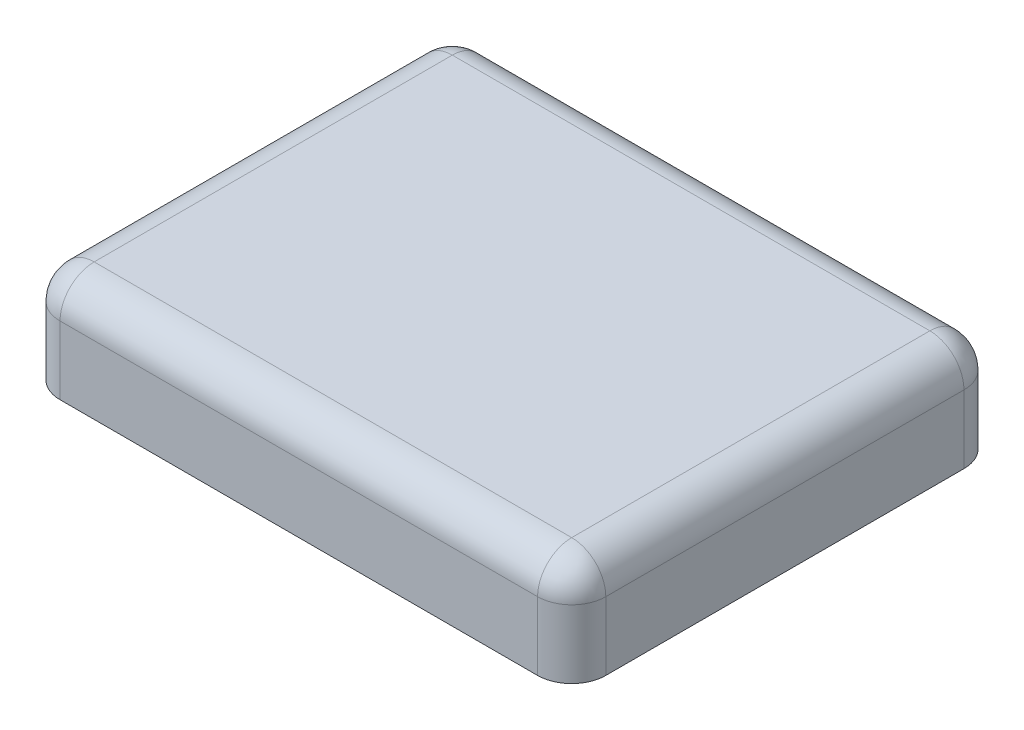
ISO-10303-21;
HEADER;
FILE_DESCRIPTION(('STEP AP214'),'2;1');
FILE_NAME('part.step','',(''),(''),'','','');
FILE_SCHEMA(('AUTOMOTIVE_DESIGN { 1 0 10303 214 1 1 1 1 }'));
ENDSEC;
DATA;
#1=APPLICATION_CONTEXT('core data for automotive mechanical design processes');
#2=APPLICATION_PROTOCOL_DEFINITION('international standard','automotive_design',2000,#1);
#3=PRODUCT_CONTEXT('',#1,'mechanical');
#4=PRODUCT('Part','Part','',(#3));
#5=PRODUCT_RELATED_PRODUCT_CATEGORY('part','',(#4));
#6=PRODUCT_DEFINITION_FORMATION('','',#4);
#7=PRODUCT_DEFINITION_CONTEXT('part definition',#1,'design');
#8=PRODUCT_DEFINITION('design','',#6,#7);
#9=PRODUCT_DEFINITION_SHAPE('','',#8);
#10=(LENGTH_UNIT() NAMED_UNIT(*) SI_UNIT(.MILLI.,.METRE.));
#11=(NAMED_UNIT(*) PLANE_ANGLE_UNIT() SI_UNIT($,.RADIAN.));
#12=(NAMED_UNIT(*) SI_UNIT($,.STERADIAN.) SOLID_ANGLE_UNIT());
#13=UNCERTAINTY_MEASURE_WITH_UNIT(LENGTH_MEASURE(1.E-05),#10,'distance_accuracy_value','');
#14=(GEOMETRIC_REPRESENTATION_CONTEXT(3) GLOBAL_UNCERTAINTY_ASSIGNED_CONTEXT((#13)) GLOBAL_UNIT_ASSIGNED_CONTEXT((#10,
#11,#12)) REPRESENTATION_CONTEXT('',''));
#15=CARTESIAN_POINT('',(0.,0.,0.));
#16=DIRECTION('',(0.,0.,1.));
#17=DIRECTION('',(1.,0.,0.));
#18=AXIS2_PLACEMENT_3D('',#15,#16,#17);
#19=CARTESIAN_POINT('',(1.6,0.6,-1.25));
#20=DIRECTION('',(-1.,0.,0.));
#21=DIRECTION('',(0.,0.,1.));
#22=AXIS2_PLACEMENT_3D('',#19,#20,#21);
#23=PLANE('',#22);
#24=DIRECTION('',(0.,-1.,0.));
#25=VECTOR('',#24,1.);
#26=CARTESIAN_POINT('',(1.6,0.6,-1.05));
#27=LINE('',#26,#25);
#28=CARTESIAN_POINT('',(1.6,0.,-1.05));
#29=VERTEX_POINT('',#28);
#30=CARTESIAN_POINT('',(1.6,0.4,-1.05));
#31=VERTEX_POINT('',#30);
#32=EDGE_CURVE('E127',#29,#31,#27,.F.);
#33=ORIENTED_EDGE('',*,*,#32,.T.);
#34=DIRECTION('',(0.,0.,-1.));
#35=VECTOR('',#34,1.);
#36=CARTESIAN_POINT('',(1.6,0.4,1.05));
#37=LINE('',#36,#35);
#38=CARTESIAN_POINT('',(1.6,0.4,1.05));
#39=VERTEX_POINT('',#38);
#40=EDGE_CURVE('E67',#31,#39,#37,.F.);
#41=ORIENTED_EDGE('',*,*,#40,.T.);
#42=DIRECTION('',(0.,-1.,0.));
#43=VECTOR('',#42,1.);
#44=CARTESIAN_POINT('',(1.6,0.6,1.05));
#45=LINE('',#44,#43);
#46=CARTESIAN_POINT('',(1.6,0.,1.05));
#47=VERTEX_POINT('',#46);
#48=EDGE_CURVE('E120',#39,#47,#45,.T.);
#49=ORIENTED_EDGE('',*,*,#48,.T.);
#50=DIRECTION('',(0.,0.,-1.));
#51=VECTOR('',#50,1.);
#52=CARTESIAN_POINT('',(1.6,0.,-1.25));
#53=LINE('',#52,#51);
#54=EDGE_CURVE('E123',#47,#29,#53,.T.);
#55=ORIENTED_EDGE('',*,*,#54,.T.);
#56=EDGE_LOOP('',(#33,#41,#49,#55));
#57=FACE_BOUND('',#56,.T.);
#58=ADVANCED_FACE('F43',(#57),#23,.F.);
#59=CARTESIAN_POINT('',(-1.6,0.6,-1.25));
#60=DIRECTION('',(0.,0.,1.));
#61=DIRECTION('',(1.,0.,0.));
#62=AXIS2_PLACEMENT_3D('',#59,#60,#61);
#63=PLANE('',#62);
#64=DIRECTION('',(0.,-1.,0.));
#65=VECTOR('',#64,1.);
#66=CARTESIAN_POINT('',(-1.4,0.6,-1.25));
#67=LINE('',#66,#65);
#68=CARTESIAN_POINT('',(-1.4,0.,-1.25));
#69=VERTEX_POINT('',#68);
#70=CARTESIAN_POINT('',(-1.4,0.4,-1.25));
#71=VERTEX_POINT('',#70);
#72=EDGE_CURVE('E160',#69,#71,#67,.F.);
#73=ORIENTED_EDGE('',*,*,#72,.T.);
#74=DIRECTION('',(-1.,0.,0.));
#75=VECTOR('',#74,1.);
#76=CARTESIAN_POINT('',(1.4,0.4,-1.25));
#77=LINE('',#76,#75);
#78=CARTESIAN_POINT('',(1.4,0.4,-1.25));
#79=VERTEX_POINT('',#78);
#80=EDGE_CURVE('E186',#71,#79,#77,.F.);
#81=ORIENTED_EDGE('',*,*,#80,.T.);
#82=DIRECTION('',(0.,-1.,0.));
#83=VECTOR('',#82,1.);
#84=CARTESIAN_POINT('',(1.4,0.6,-1.25));
#85=LINE('',#84,#83);
#86=CARTESIAN_POINT('',(1.4,0.,-1.25));
#87=VERTEX_POINT('',#86);
#88=EDGE_CURVE('E163',#79,#87,#85,.T.);
#89=ORIENTED_EDGE('',*,*,#88,.T.);
#90=DIRECTION('',(-1.,0.,0.));
#91=VECTOR('',#90,1.);
#92=CARTESIAN_POINT('',(-1.6,0.,-1.25));
#93=LINE('',#92,#91);
#94=EDGE_CURVE('E141',#87,#69,#93,.T.);
#95=ORIENTED_EDGE('',*,*,#94,.T.);
#96=EDGE_LOOP('',(#73,#81,#89,#95));
#97=FACE_BOUND('',#96,.T.);
#98=ADVANCED_FACE('F245',(#97),#63,.F.);
#99=CARTESIAN_POINT('',(-1.6,0.6,-1.25));
#100=DIRECTION('',(1.,0.,0.));
#101=DIRECTION('',(0.,0.,-1.));
#102=AXIS2_PLACEMENT_3D('',#99,#100,#101);
#103=PLANE('',#102);
#104=DIRECTION('',(0.,-1.,0.));
#105=VECTOR('',#104,1.);
#106=CARTESIAN_POINT('',(-1.6,0.6,1.05));
#107=LINE('',#106,#105);
#108=CARTESIAN_POINT('',(-1.6,0.,1.05));
#109=VERTEX_POINT('',#108);
#110=CARTESIAN_POINT('',(-1.6,0.4,1.05));
#111=VERTEX_POINT('',#110);
#112=EDGE_CURVE('E167',#109,#111,#107,.F.);
#113=ORIENTED_EDGE('',*,*,#112,.T.);
#114=DIRECTION('',(0.,0.,1.));
#115=VECTOR('',#114,1.);
#116=CARTESIAN_POINT('',(-1.6,0.4,-1.05));
#117=LINE('',#116,#115);
#118=CARTESIAN_POINT('',(-1.6,0.4,-1.05));
#119=VERTEX_POINT('',#118);
#120=EDGE_CURVE('E182',#111,#119,#117,.F.);
#121=ORIENTED_EDGE('',*,*,#120,.T.);
#122=DIRECTION('',(0.,-1.,0.));
#123=VECTOR('',#122,1.);
#124=CARTESIAN_POINT('',(-1.6,0.6,-1.05));
#125=LINE('',#124,#123);
#126=CARTESIAN_POINT('',(-1.6,0.,-1.05));
#127=VERTEX_POINT('',#126);
#128=EDGE_CURVE('E165',#119,#127,#125,.T.);
#129=ORIENTED_EDGE('',*,*,#128,.T.);
#130=DIRECTION('',(0.,0.,1.));
#131=VECTOR('',#130,1.);
#132=CARTESIAN_POINT('',(-1.6,0.,-1.25));
#133=LINE('',#132,#131);
#134=EDGE_CURVE('E144',#127,#109,#133,.T.);
#135=ORIENTED_EDGE('',*,*,#134,.T.);
#136=EDGE_LOOP('',(#113,#121,#129,#135));
#137=FACE_BOUND('',#136,.T.);
#138=ADVANCED_FACE('F251',(#137),#103,.F.);
#139=CARTESIAN_POINT('',(-1.6,0.6,1.25));
#140=DIRECTION('',(0.,0.,-1.));
#141=DIRECTION('',(-1.,0.,0.));
#142=AXIS2_PLACEMENT_3D('',#139,#140,#141);
#143=PLANE('',#142);
#144=DIRECTION('',(0.,-1.,0.));
#145=VECTOR('',#144,1.);
#146=CARTESIAN_POINT('',(1.4,0.6,1.25));
#147=LINE('',#146,#145);
#148=CARTESIAN_POINT('',(1.4,0.,1.25));
#149=VERTEX_POINT('',#148);
#150=CARTESIAN_POINT('',(1.4,0.4,1.25));
#151=VERTEX_POINT('',#150);
#152=EDGE_CURVE('E131',#149,#151,#147,.F.);
#153=ORIENTED_EDGE('',*,*,#152,.T.);
#154=DIRECTION('',(1.,0.,0.));
#155=VECTOR('',#154,1.);
#156=CARTESIAN_POINT('',(-1.4,0.4,1.25));
#157=LINE('',#156,#155);
#158=CARTESIAN_POINT('',(-1.4,0.4,1.25));
#159=VERTEX_POINT('',#158);
#160=EDGE_CURVE('E11',#151,#159,#157,.F.);
#161=ORIENTED_EDGE('',*,*,#160,.T.);
#162=DIRECTION('',(0.,-1.,0.));
#163=VECTOR('',#162,1.);
#164=CARTESIAN_POINT('',(-1.4,0.6,1.25));
#165=LINE('',#164,#163);
#166=CARTESIAN_POINT('',(-1.4,0.,1.25));
#167=VERTEX_POINT('',#166);
#168=EDGE_CURVE('E135',#159,#167,#165,.T.);
#169=ORIENTED_EDGE('',*,*,#168,.T.);
#170=DIRECTION('',(1.,0.,0.));
#171=VECTOR('',#170,1.);
#172=CARTESIAN_POINT('',(-1.6,0.,1.25));
#173=LINE('',#172,#171);
#174=EDGE_CURVE('E151',#167,#149,#173,.T.);
#175=ORIENTED_EDGE('',*,*,#174,.T.);
#176=EDGE_LOOP('',(#153,#161,#169,#175));
#177=FACE_BOUND('',#176,.T.);
#178=ADVANCED_FACE('F344',(#177),#143,.F.);
#179=CARTESIAN_POINT('',(0.,0.6,0.));
#180=DIRECTION('',(0.,1.,0.));
#181=DIRECTION('',(0.,0.,1.));
#182=AXIS2_PLACEMENT_3D('',#179,#180,#181);
#183=PLANE('',#182);
#184=DIRECTION('',(-1.,0.,0.));
#185=VECTOR('',#184,1.);
#186=CARTESIAN_POINT('',(-1.4,0.6,-1.05));
#187=LINE('',#186,#185);
#188=CARTESIAN_POINT('',(1.4,0.6,-1.05));
#189=VERTEX_POINT('',#188);
#190=CARTESIAN_POINT('',(-1.4,0.6,-1.05));
#191=VERTEX_POINT('',#190);
#192=EDGE_CURVE('E177',#189,#191,#187,.T.);
#193=ORIENTED_EDGE('',*,*,#192,.T.);
#194=DIRECTION('',(0.,0.,1.));
#195=VECTOR('',#194,1.);
#196=CARTESIAN_POINT('',(-1.4,0.6,1.05));
#197=LINE('',#196,#195);
#198=CARTESIAN_POINT('',(-1.4,0.6,1.05));
#199=VERTEX_POINT('',#198);
#200=EDGE_CURVE('E179',#191,#199,#197,.T.);
#201=ORIENTED_EDGE('',*,*,#200,.T.);
#202=DIRECTION('',(1.,0.,0.));
#203=VECTOR('',#202,1.);
#204=CARTESIAN_POINT('',(1.4,0.6,1.05));
#205=LINE('',#204,#203);
#206=CARTESIAN_POINT('',(1.4,0.6,1.05));
#207=VERTEX_POINT('',#206);
#208=EDGE_CURVE('E173',#199,#207,#205,.T.);
#209=ORIENTED_EDGE('',*,*,#208,.T.);
#210=DIRECTION('',(0.,0.,-1.));
#211=VECTOR('',#210,1.);
#212=CARTESIAN_POINT('',(1.4,0.6,-1.05));
#213=LINE('',#212,#211);
#214=EDGE_CURVE('E175',#207,#189,#213,.T.);
#215=ORIENTED_EDGE('',*,*,#214,.T.);
#216=EDGE_LOOP('',(#193,#201,#209,#215));
#217=FACE_BOUND('',#216,.T.);
#218=ADVANCED_FACE('F222',(#217),#183,.T.);
#219=CARTESIAN_POINT('',(0.,0.,0.));
#220=DIRECTION('',(0.,1.,0.));
#221=DIRECTION('',(0.,0.,1.));
#222=AXIS2_PLACEMENT_3D('',#219,#220,#221);
#223=PLANE('',#222);
#224=ORIENTED_EDGE('',*,*,#54,.F.);
#225=CARTESIAN_POINT('',(1.4,0.,1.05));
#226=DIRECTION('',(0.,1.,0.));
#227=DIRECTION('',(0.,0.,1.));
#228=AXIS2_PLACEMENT_3D('',#225,#226,#227);
#229=CIRCLE('',#228,0.2);
#230=EDGE_CURVE('E129',#47,#149,#229,.F.);
#231=ORIENTED_EDGE('',*,*,#230,.T.);
#232=ORIENTED_EDGE('',*,*,#174,.F.);
#233=CARTESIAN_POINT('',(-1.4,0.,1.05));
#234=DIRECTION('',(0.,1.,0.));
#235=DIRECTION('',(0.,0.,1.));
#236=AXIS2_PLACEMENT_3D('',#233,#234,#235);
#237=CIRCLE('',#236,0.2);
#238=EDGE_CURVE('E155',#167,#109,#237,.F.);
#239=ORIENTED_EDGE('',*,*,#238,.T.);
#240=ORIENTED_EDGE('',*,*,#134,.F.);
#241=CARTESIAN_POINT('',(-1.4,0.,-1.05));
#242=DIRECTION('',(0.,1.,0.));
#243=DIRECTION('',(0.,0.,1.));
#244=AXIS2_PLACEMENT_3D('',#241,#242,#243);
#245=CIRCLE('',#244,0.2);
#246=EDGE_CURVE('E126',#127,#69,#245,.F.);
#247=ORIENTED_EDGE('',*,*,#246,.T.);
#248=ORIENTED_EDGE('',*,*,#94,.F.);
#249=CARTESIAN_POINT('',(1.4,0.,-1.05));
#250=DIRECTION('',(0.,1.,0.));
#251=DIRECTION('',(0.,0.,1.));
#252=AXIS2_PLACEMENT_3D('',#249,#250,#251);
#253=CIRCLE('',#252,0.2);
#254=EDGE_CURVE('E136',#87,#29,#253,.F.);
#255=ORIENTED_EDGE('',*,*,#254,.T.);
#256=EDGE_LOOP('',(#224,#231,#232,#239,#240,#247,#248,#255));
#257=FACE_BOUND('',#256,.T.);
#258=ADVANCED_FACE('F138',(#257),#223,.F.);
#259=CARTESIAN_POINT('',(1.4,0.6,1.05));
#260=DIRECTION('',(0.,-1.,0.));
#261=DIRECTION('',(0.,0.,-1.));
#262=AXIS2_PLACEMENT_3D('',#259,#260,#261);
#263=CYLINDRICAL_SURFACE('',#262,0.2);
#264=ORIENTED_EDGE('',*,*,#48,.F.);
#265=CARTESIAN_POINT('',(1.4,0.4,1.05));
#266=DIRECTION('',(0.,-1.,0.));
#267=DIRECTION('',(0.,0.,-1.));
#268=AXIS2_PLACEMENT_3D('',#265,#266,#267);
#269=CIRCLE('',#268,0.2);
#270=EDGE_CURVE('E52',#39,#151,#269,.T.);
#271=ORIENTED_EDGE('',*,*,#270,.T.);
#272=ORIENTED_EDGE('',*,*,#152,.F.);
#273=ORIENTED_EDGE('',*,*,#230,.F.);
#274=EDGE_LOOP('',(#264,#271,#272,#273));
#275=FACE_BOUND('',#274,.T.);
#276=ADVANCED_FACE('F130',(#275),#263,.T.);
#277=CARTESIAN_POINT('',(1.4,0.6,-1.05));
#278=DIRECTION('',(0.,-1.,0.));
#279=DIRECTION('',(0.,0.,-1.));
#280=AXIS2_PLACEMENT_3D('',#277,#278,#279);
#281=CYLINDRICAL_SURFACE('',#280,0.2);
#282=ORIENTED_EDGE('',*,*,#88,.F.);
#283=CARTESIAN_POINT('',(1.4,0.4,-1.05));
#284=DIRECTION('',(0.,-1.,0.));
#285=DIRECTION('',(0.,0.,-1.));
#286=AXIS2_PLACEMENT_3D('',#283,#284,#285);
#287=CIRCLE('',#286,0.2);
#288=EDGE_CURVE('E188',#79,#31,#287,.T.);
#289=ORIENTED_EDGE('',*,*,#288,.T.);
#290=ORIENTED_EDGE('',*,*,#32,.F.);
#291=ORIENTED_EDGE('',*,*,#254,.F.);
#292=EDGE_LOOP('',(#282,#289,#290,#291));
#293=FACE_BOUND('',#292,.T.);
#294=ADVANCED_FACE('F258',(#293),#281,.T.);
#295=CARTESIAN_POINT('',(-1.4,0.6,1.05));
#296=DIRECTION('',(0.,-1.,0.));
#297=DIRECTION('',(0.,0.,-1.));
#298=AXIS2_PLACEMENT_3D('',#295,#296,#297);
#299=CYLINDRICAL_SURFACE('',#298,0.2);
#300=ORIENTED_EDGE('',*,*,#168,.F.);
#301=CARTESIAN_POINT('',(-1.4,0.4,1.05));
#302=DIRECTION('',(0.,-1.,0.));
#303=DIRECTION('',(0.,0.,-1.));
#304=AXIS2_PLACEMENT_3D('',#301,#302,#303);
#305=CIRCLE('',#304,0.2);
#306=EDGE_CURVE('E170',#159,#111,#305,.T.);
#307=ORIENTED_EDGE('',*,*,#306,.T.);
#308=ORIENTED_EDGE('',*,*,#112,.F.);
#309=ORIENTED_EDGE('',*,*,#238,.F.);
#310=EDGE_LOOP('',(#300,#307,#308,#309));
#311=FACE_BOUND('',#310,.T.);
#312=ADVANCED_FACE('F261',(#311),#299,.T.);
#313=CARTESIAN_POINT('',(-1.4,0.6,-1.05));
#314=DIRECTION('',(0.,-1.,0.));
#315=DIRECTION('',(0.,0.,-1.));
#316=AXIS2_PLACEMENT_3D('',#313,#314,#315);
#317=CYLINDRICAL_SURFACE('',#316,0.2);
#318=ORIENTED_EDGE('',*,*,#128,.F.);
#319=CARTESIAN_POINT('',(-1.4,0.4,-1.05));
#320=DIRECTION('',(0.,-1.,0.));
#321=DIRECTION('',(0.,0.,-1.));
#322=AXIS2_PLACEMENT_3D('',#319,#320,#321);
#323=CIRCLE('',#322,0.2);
#324=EDGE_CURVE('E184',#119,#71,#323,.T.);
#325=ORIENTED_EDGE('',*,*,#324,.T.);
#326=ORIENTED_EDGE('',*,*,#72,.F.);
#327=ORIENTED_EDGE('',*,*,#246,.F.);
#328=EDGE_LOOP('',(#318,#325,#326,#327));
#329=FACE_BOUND('',#328,.T.);
#330=ADVANCED_FACE('F265',(#329),#317,.T.);
#331=CARTESIAN_POINT('',(1.4,0.4,-1.05));
#332=DIRECTION('',(0.,1.,0.));
#333=DIRECTION('',(0.,0.,1.));
#334=AXIS2_PLACEMENT_3D('',#331,#332,#333);
#335=SPHERICAL_SURFACE('',#334,0.2);
#336=CARTESIAN_POINT('',(1.4,0.4,-1.05));
#337=DIRECTION('',(0.,0.,1.));
#338=DIRECTION('',(1.,0.,0.));
#339=AXIS2_PLACEMENT_3D('',#336,#337,#338);
#340=CIRCLE('',#339,0.2);
#341=EDGE_CURVE('E147',#31,#189,#340,.T.);
#342=ORIENTED_EDGE('',*,*,#341,.F.);
#343=ORIENTED_EDGE('',*,*,#288,.F.);
#344=CARTESIAN_POINT('',(1.4,0.4,-1.05));
#345=DIRECTION('',(-1.,0.,0.));
#346=DIRECTION('',(0.,0.,1.));
#347=AXIS2_PLACEMENT_3D('',#344,#345,#346);
#348=CIRCLE('',#347,0.2);
#349=EDGE_CURVE('E47',#189,#79,#348,.T.);
#350=ORIENTED_EDGE('',*,*,#349,.F.);
#351=EDGE_LOOP('',(#342,#343,#350));
#352=FACE_BOUND('',#351,.T.);
#353=ADVANCED_FACE('F45',(#352),#335,.T.);
#354=CARTESIAN_POINT('',(0.,0.4,-1.05));
#355=DIRECTION('',(1.,0.,0.));
#356=DIRECTION('',(0.,0.,-1.));
#357=AXIS2_PLACEMENT_3D('',#354,#355,#356);
#358=CYLINDRICAL_SURFACE('',#357,0.2);
#359=ORIENTED_EDGE('',*,*,#349,.T.);
#360=ORIENTED_EDGE('',*,*,#80,.F.);
#361=CARTESIAN_POINT('',(-1.4,0.4,-1.05));
#362=DIRECTION('',(-1.,0.,0.));
#363=DIRECTION('',(0.,0.,1.));
#364=AXIS2_PLACEMENT_3D('',#361,#362,#363);
#365=CIRCLE('',#364,0.2);
#366=EDGE_CURVE('E205',#191,#71,#365,.T.);
#367=ORIENTED_EDGE('',*,*,#366,.F.);
#368=ORIENTED_EDGE('',*,*,#192,.F.);
#369=EDGE_LOOP('',(#359,#360,#367,#368));
#370=FACE_BOUND('',#369,.T.);
#371=ADVANCED_FACE('F219',(#370),#358,.T.);
#372=CARTESIAN_POINT('',(1.4,0.4,0.));
#373=DIRECTION('',(0.,0.,1.));
#374=DIRECTION('',(1.,0.,0.));
#375=AXIS2_PLACEMENT_3D('',#372,#373,#374);
#376=CYLINDRICAL_SURFACE('',#375,0.2);
#377=ORIENTED_EDGE('',*,*,#341,.T.);
#378=ORIENTED_EDGE('',*,*,#214,.F.);
#379=CARTESIAN_POINT('',(1.4,0.4,1.05));
#380=DIRECTION('',(0.,0.,1.));
#381=DIRECTION('',(1.,0.,0.));
#382=AXIS2_PLACEMENT_3D('',#379,#380,#381);
#383=CIRCLE('',#382,0.2);
#384=EDGE_CURVE('E202',#39,#207,#383,.T.);
#385=ORIENTED_EDGE('',*,*,#384,.F.);
#386=ORIENTED_EDGE('',*,*,#40,.F.);
#387=EDGE_LOOP('',(#377,#378,#385,#386));
#388=FACE_BOUND('',#387,.T.);
#389=ADVANCED_FACE('F212',(#388),#376,.T.);
#390=CARTESIAN_POINT('',(-1.4,0.4,-1.05));
#391=DIRECTION('',(0.,1.,0.));
#392=DIRECTION('',(0.,0.,1.));
#393=AXIS2_PLACEMENT_3D('',#390,#391,#392);
#394=SPHERICAL_SURFACE('',#393,0.2);
#395=ORIENTED_EDGE('',*,*,#366,.T.);
#396=ORIENTED_EDGE('',*,*,#324,.F.);
#397=CARTESIAN_POINT('',(-1.4,0.4,-1.05));
#398=DIRECTION('',(0.,0.,1.));
#399=DIRECTION('',(1.,0.,0.));
#400=AXIS2_PLACEMENT_3D('',#397,#398,#399);
#401=CIRCLE('',#400,0.2);
#402=EDGE_CURVE('E199',#191,#119,#401,.T.);
#403=ORIENTED_EDGE('',*,*,#402,.F.);
#404=EDGE_LOOP('',(#395,#396,#403));
#405=FACE_BOUND('',#404,.T.);
#406=ADVANCED_FACE('F234',(#405),#394,.T.);
#407=CARTESIAN_POINT('',(1.4,0.4,1.05));
#408=DIRECTION('',(0.,1.,0.));
#409=DIRECTION('',(0.,0.,1.));
#410=AXIS2_PLACEMENT_3D('',#407,#408,#409);
#411=SPHERICAL_SURFACE('',#410,0.2);
#412=ORIENTED_EDGE('',*,*,#270,.F.);
#413=ORIENTED_EDGE('',*,*,#384,.T.);
#414=CARTESIAN_POINT('',(1.4,0.4,1.05));
#415=DIRECTION('',(-1.,0.,0.));
#416=DIRECTION('',(0.,0.,1.));
#417=AXIS2_PLACEMENT_3D('',#414,#415,#416);
#418=CIRCLE('',#417,0.2);
#419=EDGE_CURVE('E196',#151,#207,#418,.T.);
#420=ORIENTED_EDGE('',*,*,#419,.F.);
#421=EDGE_LOOP('',(#412,#413,#420));
#422=FACE_BOUND('',#421,.T.);
#423=ADVANCED_FACE('F231',(#422),#411,.T.);
#424=CARTESIAN_POINT('',(-1.4,0.4,0.));
#425=DIRECTION('',(0.,0.,-1.));
#426=DIRECTION('',(-1.,0.,0.));
#427=AXIS2_PLACEMENT_3D('',#424,#425,#426);
#428=CYLINDRICAL_SURFACE('',#427,0.2);
#429=ORIENTED_EDGE('',*,*,#402,.T.);
#430=ORIENTED_EDGE('',*,*,#120,.F.);
#431=CARTESIAN_POINT('',(-1.4,0.4,1.05));
#432=DIRECTION('',(0.,0.,1.));
#433=DIRECTION('',(1.,0.,0.));
#434=AXIS2_PLACEMENT_3D('',#431,#432,#433);
#435=CIRCLE('',#434,0.2);
#436=EDGE_CURVE('E194',#199,#111,#435,.T.);
#437=ORIENTED_EDGE('',*,*,#436,.F.);
#438=ORIENTED_EDGE('',*,*,#200,.F.);
#439=EDGE_LOOP('',(#429,#430,#437,#438));
#440=FACE_BOUND('',#439,.T.);
#441=ADVANCED_FACE('F233',(#440),#428,.T.);
#442=CARTESIAN_POINT('',(0.,0.4,1.05));
#443=DIRECTION('',(-1.,0.,0.));
#444=DIRECTION('',(0.,0.,1.));
#445=AXIS2_PLACEMENT_3D('',#442,#443,#444);
#446=CYLINDRICAL_SURFACE('',#445,0.2);
#447=ORIENTED_EDGE('',*,*,#419,.T.);
#448=ORIENTED_EDGE('',*,*,#208,.F.);
#449=CARTESIAN_POINT('',(-1.4,0.4,1.05));
#450=DIRECTION('',(-1.,0.,0.));
#451=DIRECTION('',(0.,0.,1.));
#452=AXIS2_PLACEMENT_3D('',#449,#450,#451);
#453=CIRCLE('',#452,0.2);
#454=EDGE_CURVE('E192',#159,#199,#453,.T.);
#455=ORIENTED_EDGE('',*,*,#454,.F.);
#456=ORIENTED_EDGE('',*,*,#160,.F.);
#457=EDGE_LOOP('',(#447,#448,#455,#456));
#458=FACE_BOUND('',#457,.T.);
#459=ADVANCED_FACE('F227',(#458),#446,.T.);
#460=CARTESIAN_POINT('',(-1.4,0.4,1.05));
#461=DIRECTION('',(0.,1.,0.));
#462=DIRECTION('',(0.,0.,1.));
#463=AXIS2_PLACEMENT_3D('',#460,#461,#462);
#464=SPHERICAL_SURFACE('',#463,0.2);
#465=ORIENTED_EDGE('',*,*,#436,.T.);
#466=ORIENTED_EDGE('',*,*,#306,.F.);
#467=ORIENTED_EDGE('',*,*,#454,.T.);
#468=EDGE_LOOP('',(#465,#466,#467));
#469=FACE_BOUND('',#468,.T.);
#470=ADVANCED_FACE('F270',(#469),#464,.T.);
#471=CLOSED_SHELL('',(#58,#98,#138,#178,#218,#258,#276,#294,#312,#330,#353,#371,#389,#406,#423,
#441,#459,#470));
#472=MANIFOLD_SOLID_BREP('B2',#471);
#473=ADVANCED_BREP_SHAPE_REPRESENTATION('',(#18,#472),#14);
#474=SHAPE_DEFINITION_REPRESENTATION(#9,#473);
ENDSEC;
END-ISO-10303-21;
